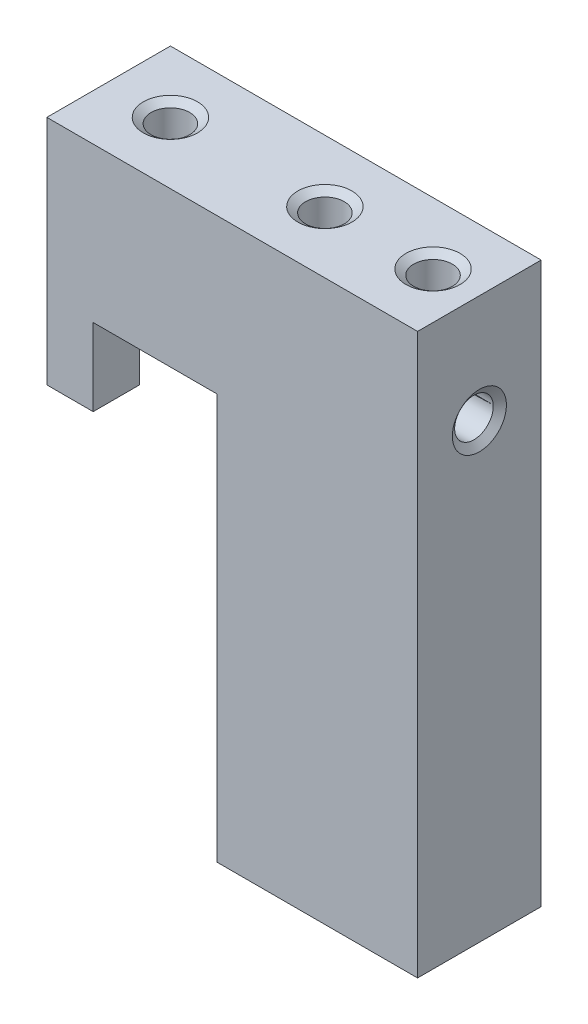
ISO-10303-21;
HEADER;
FILE_DESCRIPTION(('STEP AP214'),'2;1');
FILE_NAME('part.step','',(''),(''),'','','');
FILE_SCHEMA(('AUTOMOTIVE_DESIGN { 1 0 10303 214 1 1 1 1 }'));
ENDSEC;
DATA;
#1=APPLICATION_CONTEXT('core data for automotive mechanical design processes');
#2=APPLICATION_PROTOCOL_DEFINITION('international standard','automotive_design',2000,#1);
#3=PRODUCT_CONTEXT('',#1,'mechanical');
#4=PRODUCT('Part','Part','',(#3));
#5=PRODUCT_RELATED_PRODUCT_CATEGORY('part','',(#4));
#6=PRODUCT_DEFINITION_FORMATION('','',#4);
#7=PRODUCT_DEFINITION_CONTEXT('part definition',#1,'design');
#8=PRODUCT_DEFINITION('design','',#6,#7);
#9=PRODUCT_DEFINITION_SHAPE('','',#8);
#10=(LENGTH_UNIT() NAMED_UNIT(*) SI_UNIT(.MILLI.,.METRE.));
#11=(NAMED_UNIT(*) PLANE_ANGLE_UNIT() SI_UNIT($,.RADIAN.));
#12=(NAMED_UNIT(*) SI_UNIT($,.STERADIAN.) SOLID_ANGLE_UNIT());
#13=UNCERTAINTY_MEASURE_WITH_UNIT(LENGTH_MEASURE(1.E-05),#10,'distance_accuracy_value','');
#14=(GEOMETRIC_REPRESENTATION_CONTEXT(3) GLOBAL_UNCERTAINTY_ASSIGNED_CONTEXT((#13)) GLOBAL_UNIT_ASSIGNED_CONTEXT((#10,
#11,#12)) REPRESENTATION_CONTEXT('',''));
#15=CARTESIAN_POINT('',(0.,0.,0.));
#16=DIRECTION('',(0.,0.,1.));
#17=DIRECTION('',(1.,0.,0.));
#18=AXIS2_PLACEMENT_3D('',#15,#16,#17);
#19=CARTESIAN_POINT('',(11.,26.25,8.));
#20=DIRECTION('',(1.,0.,0.));
#21=DIRECTION('',(0.,1.,0.));
#22=AXIS2_PLACEMENT_3D('',#19,#20,#21);
#23=PLANE('',#22);
#24=DIRECTION('',(0.,-1.,0.));
#25=VECTOR('',#24,1.);
#26=CARTESIAN_POINT('',(11.,18.125,5.));
#27=LINE('',#26,#25);
#28=CARTESIAN_POINT('',(11.,26.25,5.));
#29=VERTEX_POINT('',#28);
#30=CARTESIAN_POINT('',(11.,0.,5.));
#31=VERTEX_POINT('',#30);
#32=EDGE_CURVE('E51',#29,#31,#27,.T.);
#33=ORIENTED_EDGE('',*,*,#32,.T.);
#34=DIRECTION('',(0.,0.,-1.));
#35=VECTOR('',#34,1.);
#36=CARTESIAN_POINT('',(11.,0.,8.));
#37=LINE('',#36,#35);
#38=CARTESIAN_POINT('',(11.,0.,8.));
#39=VERTEX_POINT('',#38);
#40=EDGE_CURVE('E291',#39,#31,#37,.T.);
#41=ORIENTED_EDGE('',*,*,#40,.F.);
#42=DIRECTION('',(0.,-1.,0.));
#43=VECTOR('',#42,1.);
#44=CARTESIAN_POINT('',(11.,26.25,8.));
#45=LINE('',#44,#43);
#46=CARTESIAN_POINT('',(11.,26.25,8.));
#47=VERTEX_POINT('',#46);
#48=EDGE_CURVE('E289',#47,#39,#45,.T.);
#49=ORIENTED_EDGE('',*,*,#48,.F.);
#50=DIRECTION('',(0.,0.,-1.));
#51=VECTOR('',#50,1.);
#52=CARTESIAN_POINT('',(11.,26.25,8.));
#53=LINE('',#52,#51);
#54=EDGE_CURVE('E292',#47,#29,#53,.T.);
#55=ORIENTED_EDGE('',*,*,#54,.T.);
#56=EDGE_LOOP('',(#33,#41,#49,#55));
#57=FACE_BOUND('',#56,.T.);
#58=ADVANCED_FACE('F36',(#57),#23,.F.);
#59=CARTESIAN_POINT('',(0.,0.,8.));
#60=DIRECTION('',(1.,0.,0.));
#61=DIRECTION('',(0.,0.,-1.));
#62=AXIS2_PLACEMENT_3D('',#59,#60,#61);
#63=PLANE('',#62);
#64=CARTESIAN_POINT('',(0.,29.25,4.));
#65=DIRECTION('',(-1.,0.,0.));
#66=DIRECTION('',(0.,0.,1.));
#67=AXIS2_PLACEMENT_3D('',#64,#65,#66);
#68=CIRCLE('',#67,1.75);
#69=CARTESIAN_POINT('',(0.,29.25,5.75));
#70=VERTEX_POINT('',#69);
#71=EDGE_CURVE('E261',#70,#70,#68,.T.);
#72=ORIENTED_EDGE('',*,*,#71,.F.);
#73=EDGE_LOOP('',(#72));
#74=FACE_BOUND('',#73,.T.);
#75=DIRECTION('',(0.,0.,-1.));
#76=VECTOR('',#75,1.);
#77=CARTESIAN_POINT('',(0.,23.25,35.0474120758345));
#78=LINE('',#77,#76);
#79=CARTESIAN_POINT('',(0.,23.25,5.));
#80=VERTEX_POINT('',#79);
#81=CARTESIAN_POINT('',(0.,23.25,0.));
#82=VERTEX_POINT('',#81);
#83=EDGE_CURVE('E235',#80,#82,#78,.T.);
#84=ORIENTED_EDGE('',*,*,#83,.F.);
#85=DIRECTION('',(0.,-1.,0.));
#86=VECTOR('',#85,1.);
#87=CARTESIAN_POINT('',(0.,18.125,5.));
#88=LINE('',#87,#86);
#89=CARTESIAN_POINT('',(0.,21.25,5.));
#90=VERTEX_POINT('',#89);
#91=EDGE_CURVE('E219',#80,#90,#88,.T.);
#92=ORIENTED_EDGE('',*,*,#91,.T.);
#93=DIRECTION('',(0.,0.,-1.));
#94=VECTOR('',#93,1.);
#95=CARTESIAN_POINT('',(0.,21.25,8.));
#96=LINE('',#95,#94);
#97=CARTESIAN_POINT('',(0.,21.25,8.));
#98=VERTEX_POINT('',#97);
#99=EDGE_CURVE('E288',#98,#90,#96,.T.);
#100=ORIENTED_EDGE('',*,*,#99,.F.);
#101=DIRECTION('',(0.,-1.,0.));
#102=VECTOR('',#101,1.);
#103=CARTESIAN_POINT('',(0.,0.,8.));
#104=LINE('',#103,#102);
#105=CARTESIAN_POINT('',(0.,36.25,8.));
#106=VERTEX_POINT('',#105);
#107=EDGE_CURVE('E312',#106,#98,#104,.T.);
#108=ORIENTED_EDGE('',*,*,#107,.F.);
#109=DIRECTION('',(0.,0.,-1.));
#110=VECTOR('',#109,1.);
#111=CARTESIAN_POINT('',(0.,36.25,8.));
#112=LINE('',#111,#110);
#113=CARTESIAN_POINT('',(0.,36.25,0.));
#114=VERTEX_POINT('',#113);
#115=EDGE_CURVE('E322',#106,#114,#112,.T.);
#116=ORIENTED_EDGE('',*,*,#115,.T.);
#117=DIRECTION('',(0.,-1.,0.));
#118=VECTOR('',#117,1.);
#119=CARTESIAN_POINT('',(0.,0.,0.));
#120=LINE('',#119,#118);
#121=EDGE_CURVE('E309',#114,#82,#120,.T.);
#122=ORIENTED_EDGE('',*,*,#121,.T.);
#123=EDGE_LOOP('',(#84,#92,#100,#108,#116,#122));
#124=FACE_BOUND('',#123,.T.);
#125=ADVANCED_FACE('F38',(#74,#124),#63,.F.);
#126=CARTESIAN_POINT('',(0.,36.25,0.));
#127=DIRECTION('',(0.,0.,-1.));
#128=DIRECTION('',(-1.,0.,0.));
#129=AXIS2_PLACEMENT_3D('',#126,#127,#128);
#130=PLANE('',#129);
#131=CARTESIAN_POINT('',(12.,24.25,0.));
#132=DIRECTION('',(0.,0.,-1.));
#133=DIRECTION('',(-1.,0.,0.));
#134=AXIS2_PLACEMENT_3D('',#131,#132,#133);
#135=CIRCLE('',#134,2.5);
#136=CARTESIAN_POINT('',(10.5,26.25,0.));
#137=VERTEX_POINT('',#136);
#138=CARTESIAN_POINT('',(14.5,24.25,0.));
#139=VERTEX_POINT('',#138);
#140=EDGE_CURVE('E200',#137,#139,#135,.T.);
#141=ORIENTED_EDGE('',*,*,#140,.F.);
#142=DIRECTION('',(1.,0.,0.));
#143=VECTOR('',#142,1.);
#144=CARTESIAN_POINT('',(0.,26.25,0.));
#145=LINE('',#144,#143);
#146=CARTESIAN_POINT('',(3.,26.25,0.));
#147=VERTEX_POINT('',#146);
#148=EDGE_CURVE('E339',#147,#137,#145,.T.);
#149=ORIENTED_EDGE('',*,*,#148,.F.);
#150=DIRECTION('',(0.,1.,0.));
#151=VECTOR('',#150,1.);
#152=CARTESIAN_POINT('',(3.,36.25,0.));
#153=LINE('',#152,#151);
#154=CARTESIAN_POINT('',(3.,25.0292254112385,0.));
#155=VERTEX_POINT('',#154);
#156=EDGE_CURVE('E337',#155,#147,#153,.T.);
#157=ORIENTED_EDGE('',*,*,#156,.F.);
#158=DIRECTION('',(-0.819152044288995,-0.573576436351041,0.));
#159=VECTOR('',#158,1.);
#160=CARTESIAN_POINT('',(-16.9902681636719,11.0318889522021,0.));
#161=LINE('',#160,#159);
#162=CARTESIAN_POINT('',(0.45900277539471,23.25,0.));
#163=VERTEX_POINT('',#162);
#164=EDGE_CURVE('E215',#155,#163,#161,.T.);
#165=ORIENTED_EDGE('',*,*,#164,.T.);
#166=DIRECTION('',(-1.,0.,0.));
#167=VECTOR('',#166,1.);
#168=CARTESIAN_POINT('',(-21.9569179886986,23.25,0.));
#169=LINE('',#168,#167);
#170=EDGE_CURVE('E230',#163,#82,#169,.T.);
#171=ORIENTED_EDGE('',*,*,#170,.T.);
#172=ORIENTED_EDGE('',*,*,#121,.F.);
#173=DIRECTION('',(-1.,0.,0.));
#174=VECTOR('',#173,1.);
#175=CARTESIAN_POINT('',(0.,36.25,0.));
#176=LINE('',#175,#174);
#177=CARTESIAN_POINT('',(24.,36.25,0.));
#178=VERTEX_POINT('',#177);
#179=EDGE_CURVE('E316',#178,#114,#176,.T.);
#180=ORIENTED_EDGE('',*,*,#179,.F.);
#181=DIRECTION('',(0.,1.,0.));
#182=VECTOR('',#181,1.);
#183=CARTESIAN_POINT('',(24.,0.,0.));
#184=LINE('',#183,#182);
#185=CARTESIAN_POINT('',(24.,0.,0.));
#186=VERTEX_POINT('',#185);
#187=EDGE_CURVE('E326',#186,#178,#184,.T.);
#188=ORIENTED_EDGE('',*,*,#187,.F.);
#189=DIRECTION('',(1.,0.,0.));
#190=VECTOR('',#189,1.);
#191=CARTESIAN_POINT('',(0.,0.,0.));
#192=LINE('',#191,#190);
#193=CARTESIAN_POINT('',(12.,0.,0.));
#194=VERTEX_POINT('',#193);
#195=EDGE_CURVE('E199',#194,#186,#192,.T.);
#196=ORIENTED_EDGE('',*,*,#195,.F.);
#197=DIRECTION('',(0.,-1.,0.));
#198=VECTOR('',#197,1.);
#199=CARTESIAN_POINT('',(12.,18.125,0.));
#200=LINE('',#199,#198);
#201=CARTESIAN_POINT('',(12.,20.75,0.));
#202=VERTEX_POINT('',#201);
#203=EDGE_CURVE('E177',#202,#194,#200,.T.);
#204=ORIENTED_EDGE('',*,*,#203,.F.);
#205=CARTESIAN_POINT('',(12.,23.25,0.));
#206=DIRECTION('',(0.,0.,-1.));
#207=DIRECTION('',(-1.,0.,0.));
#208=AXIS2_PLACEMENT_3D('',#205,#206,#207);
#209=CIRCLE('',#208,2.5);
#210=CARTESIAN_POINT('',(14.5,23.25,0.));
#211=VERTEX_POINT('',#210);
#212=EDGE_CURVE('E187',#202,#211,#209,.F.);
#213=ORIENTED_EDGE('',*,*,#212,.T.);
#214=DIRECTION('',(0.,-1.,0.));
#215=VECTOR('',#214,1.);
#216=CARTESIAN_POINT('',(14.5,18.125,0.));
#217=LINE('',#216,#215);
#218=EDGE_CURVE('E184',#139,#211,#217,.T.);
#219=ORIENTED_EDGE('',*,*,#218,.F.);
#220=EDGE_LOOP('',(#141,#149,#157,#165,#171,#172,#180,#188,#196,#204,#213,#219));
#221=FACE_BOUND('',#220,.T.);
#222=ADVANCED_FACE('F197',(#221),#130,.T.);
#223=CARTESIAN_POINT('',(3.,26.25,8.));
#224=DIRECTION('',(-1.,0.,0.));
#225=DIRECTION('',(0.,-1.,0.));
#226=AXIS2_PLACEMENT_3D('',#223,#224,#225);
#227=PLANE('',#226);
#228=DIRECTION('',(0.,0.,-1.));
#229=VECTOR('',#228,1.);
#230=CARTESIAN_POINT('',(3.,25.0292254112385,35.0474120758345));
#231=LINE('',#230,#229);
#232=CARTESIAN_POINT('',(3.,25.0292254112385,5.));
#233=VERTEX_POINT('',#232);
#234=EDGE_CURVE('E233',#233,#155,#231,.T.);
#235=ORIENTED_EDGE('',*,*,#234,.T.);
#236=ORIENTED_EDGE('',*,*,#156,.T.);
#237=DIRECTION('',(0.,0.,-1.));
#238=VECTOR('',#237,1.);
#239=CARTESIAN_POINT('',(3.,26.25,8.));
#240=LINE('',#239,#238);
#241=CARTESIAN_POINT('',(3.,26.25,8.));
#242=VERTEX_POINT('',#241);
#243=EDGE_CURVE('E295',#242,#147,#240,.T.);
#244=ORIENTED_EDGE('',*,*,#243,.F.);
#245=DIRECTION('',(0.,1.,0.));
#246=VECTOR('',#245,1.);
#247=CARTESIAN_POINT('',(3.,26.25,8.));
#248=LINE('',#247,#246);
#249=CARTESIAN_POINT('',(3.,21.25,8.));
#250=VERTEX_POINT('',#249);
#251=EDGE_CURVE('E296',#250,#242,#248,.T.);
#252=ORIENTED_EDGE('',*,*,#251,.F.);
#253=DIRECTION('',(0.,0.,-1.));
#254=VECTOR('',#253,1.);
#255=CARTESIAN_POINT('',(3.,21.25,8.));
#256=LINE('',#255,#254);
#257=CARTESIAN_POINT('',(3.,21.25,5.));
#258=VERTEX_POINT('',#257);
#259=EDGE_CURVE('E298',#250,#258,#256,.T.);
#260=ORIENTED_EDGE('',*,*,#259,.T.);
#261=DIRECTION('',(0.,1.,0.));
#262=VECTOR('',#261,1.);
#263=CARTESIAN_POINT('',(3.,18.125,5.));
#264=LINE('',#263,#262);
#265=EDGE_CURVE('E59',#258,#233,#264,.T.);
#266=ORIENTED_EDGE('',*,*,#265,.T.);
#267=EDGE_LOOP('',(#235,#236,#244,#252,#260,#266));
#268=FACE_BOUND('',#267,.T.);
#269=ADVANCED_FACE('F392',(#268),#227,.F.);
#270=CARTESIAN_POINT('',(3.,21.25,8.));
#271=DIRECTION('',(0.,1.,0.));
#272=DIRECTION('',(0.,0.,1.));
#273=AXIS2_PLACEMENT_3D('',#270,#271,#272);
#274=PLANE('',#273);
#275=DIRECTION('',(1.,0.,0.));
#276=VECTOR('',#275,1.);
#277=CARTESIAN_POINT('',(-21.9569179886986,21.25,5.));
#278=LINE('',#277,#276);
#279=EDGE_CURVE('E217',#90,#258,#278,.T.);
#280=ORIENTED_EDGE('',*,*,#279,.T.);
#281=ORIENTED_EDGE('',*,*,#259,.F.);
#282=DIRECTION('',(1.,0.,0.));
#283=VECTOR('',#282,1.);
#284=CARTESIAN_POINT('',(3.,21.25,8.));
#285=LINE('',#284,#283);
#286=EDGE_CURVE('E299',#98,#250,#285,.T.);
#287=ORIENTED_EDGE('',*,*,#286,.F.);
#288=ORIENTED_EDGE('',*,*,#99,.T.);
#289=EDGE_LOOP('',(#280,#281,#287,#288));
#290=FACE_BOUND('',#289,.T.);
#291=ADVANCED_FACE('F401',(#290),#274,.F.);
#292=CARTESIAN_POINT('',(0.,0.,8.));
#293=DIRECTION('',(0.,1.,0.));
#294=DIRECTION('',(0.,0.,1.));
#295=AXIS2_PLACEMENT_3D('',#292,#293,#294);
#296=PLANE('',#295);
#297=CARTESIAN_POINT('',(15.,0.,4.));
#298=DIRECTION('',(0.,-1.,0.));
#299=DIRECTION('',(0.,0.,-1.));
#300=AXIS2_PLACEMENT_3D('',#297,#298,#299);
#301=CIRCLE('',#300,1.6);
#302=CARTESIAN_POINT('',(15.,0.,2.4));
#303=VERTEX_POINT('',#302);
#304=EDGE_CURVE('E270',#303,#303,#301,.T.);
#305=ORIENTED_EDGE('',*,*,#304,.F.);
#306=EDGE_LOOP('',(#305));
#307=FACE_BOUND('',#306,.T.);
#308=CARTESIAN_POINT('',(20.,0.,4.));
#309=DIRECTION('',(0.,-1.,0.));
#310=DIRECTION('',(0.,0.,-1.));
#311=AXIS2_PLACEMENT_3D('',#308,#309,#310);
#312=CIRCLE('',#311,1.6);
#313=CARTESIAN_POINT('',(20.,0.,2.4));
#314=VERTEX_POINT('',#313);
#315=EDGE_CURVE('E279',#314,#314,#312,.T.);
#316=ORIENTED_EDGE('',*,*,#315,.F.);
#317=EDGE_LOOP('',(#316));
#318=FACE_BOUND('',#317,.T.);
#319=DIRECTION('',(1.,0.,0.));
#320=VECTOR('',#319,1.);
#321=CARTESIAN_POINT('',(-21.9569179886986,0.,5.));
#322=LINE('',#321,#320);
#323=CARTESIAN_POINT('',(12.,0.,5.));
#324=VERTEX_POINT('',#323);
#325=EDGE_CURVE('E208',#31,#324,#322,.T.);
#326=ORIENTED_EDGE('',*,*,#325,.T.);
#327=DIRECTION('',(0.,0.,-1.));
#328=VECTOR('',#327,1.);
#329=CARTESIAN_POINT('',(12.,0.,35.0474120758345));
#330=LINE('',#329,#328);
#331=EDGE_CURVE('E183',#324,#194,#330,.T.);
#332=ORIENTED_EDGE('',*,*,#331,.T.);
#333=ORIENTED_EDGE('',*,*,#195,.T.);
#334=DIRECTION('',(0.,0.,-1.));
#335=VECTOR('',#334,1.);
#336=CARTESIAN_POINT('',(24.,0.,8.));
#337=LINE('',#336,#335);
#338=CARTESIAN_POINT('',(24.,0.,8.));
#339=VERTEX_POINT('',#338);
#340=EDGE_CURVE('E334',#339,#186,#337,.T.);
#341=ORIENTED_EDGE('',*,*,#340,.F.);
#342=DIRECTION('',(1.,0.,0.));
#343=VECTOR('',#342,1.);
#344=CARTESIAN_POINT('',(0.,0.,8.));
#345=LINE('',#344,#343);
#346=EDGE_CURVE('E315',#39,#339,#345,.T.);
#347=ORIENTED_EDGE('',*,*,#346,.F.);
#348=ORIENTED_EDGE('',*,*,#40,.T.);
#349=EDGE_LOOP('',(#326,#332,#333,#341,#347,#348));
#350=FACE_BOUND('',#349,.T.);
#351=ADVANCED_FACE('F398',(#307,#318,#350),#296,.F.);
#352=CARTESIAN_POINT('',(24.,0.,8.));
#353=DIRECTION('',(-1.,0.,0.));
#354=DIRECTION('',(0.,0.,1.));
#355=AXIS2_PLACEMENT_3D('',#352,#353,#354);
#356=PLANE('',#355);
#357=CARTESIAN_POINT('',(24.,29.25,4.));
#358=DIRECTION('',(-1.,0.,0.));
#359=DIRECTION('',(0.,0.,1.));
#360=AXIS2_PLACEMENT_3D('',#357,#358,#359);
#361=CIRCLE('',#360,1.74999999999999);
#362=CARTESIAN_POINT('',(24.,29.25,5.74999999999999));
#363=VERTEX_POINT('',#362);
#364=EDGE_CURVE('E258',#363,#363,#361,.T.);
#365=ORIENTED_EDGE('',*,*,#364,.T.);
#366=EDGE_LOOP('',(#365));
#367=FACE_BOUND('',#366,.T.);
#368=ORIENTED_EDGE('',*,*,#187,.T.);
#369=DIRECTION('',(0.,0.,-1.));
#370=VECTOR('',#369,1.);
#371=CARTESIAN_POINT('',(24.,36.25,8.));
#372=LINE('',#371,#370);
#373=CARTESIAN_POINT('',(24.,36.25,8.));
#374=VERTEX_POINT('',#373);
#375=EDGE_CURVE('E331',#374,#178,#372,.T.);
#376=ORIENTED_EDGE('',*,*,#375,.F.);
#377=DIRECTION('',(0.,1.,0.));
#378=VECTOR('',#377,1.);
#379=CARTESIAN_POINT('',(24.,0.,8.));
#380=LINE('',#379,#378);
#381=EDGE_CURVE('E318',#339,#374,#380,.T.);
#382=ORIENTED_EDGE('',*,*,#381,.F.);
#383=ORIENTED_EDGE('',*,*,#340,.T.);
#384=EDGE_LOOP('',(#368,#376,#382,#383));
#385=FACE_BOUND('',#384,.T.);
#386=ADVANCED_FACE('F395',(#367,#385),#356,.F.);
#387=CARTESIAN_POINT('',(0.,36.25,8.));
#388=DIRECTION('',(0.,-1.,0.));
#389=DIRECTION('',(0.,0.,-1.));
#390=AXIS2_PLACEMENT_3D('',#387,#388,#389);
#391=PLANE('',#390);
#392=CARTESIAN_POINT('',(14.,36.25,3.99999999999995));
#393=DIRECTION('',(0.,1.,0.));
#394=DIRECTION('',(0.,0.,1.));
#395=AXIS2_PLACEMENT_3D('',#392,#393,#394);
#396=CIRCLE('',#395,1.75);
#397=CARTESIAN_POINT('',(14.,36.25,5.74999999999995));
#398=VERTEX_POINT('',#397);
#399=EDGE_CURVE('E240',#398,#398,#396,.T.);
#400=ORIENTED_EDGE('',*,*,#399,.F.);
#401=EDGE_LOOP('',(#400));
#402=FACE_BOUND('',#401,.T.);
#403=CARTESIAN_POINT('',(4.,36.25,3.99999999999995));
#404=DIRECTION('',(0.,1.,0.));
#405=DIRECTION('',(0.,0.,1.));
#406=AXIS2_PLACEMENT_3D('',#403,#404,#405);
#407=CIRCLE('',#406,1.75);
#408=CARTESIAN_POINT('',(4.,36.25,5.74999999999995));
#409=VERTEX_POINT('',#408);
#410=EDGE_CURVE('E246',#409,#409,#407,.T.);
#411=ORIENTED_EDGE('',*,*,#410,.F.);
#412=EDGE_LOOP('',(#411));
#413=FACE_BOUND('',#412,.T.);
#414=CARTESIAN_POINT('',(21.,36.25,3.99999999999995));
#415=DIRECTION('',(0.,1.,0.));
#416=DIRECTION('',(0.,0.,1.));
#417=AXIS2_PLACEMENT_3D('',#414,#415,#416);
#418=CIRCLE('',#417,1.75);
#419=CARTESIAN_POINT('',(21.,36.25,5.74999999999995));
#420=VERTEX_POINT('',#419);
#421=EDGE_CURVE('E252',#420,#420,#418,.T.);
#422=ORIENTED_EDGE('',*,*,#421,.F.);
#423=EDGE_LOOP('',(#422));
#424=FACE_BOUND('',#423,.T.);
#425=ORIENTED_EDGE('',*,*,#179,.T.);
#426=ORIENTED_EDGE('',*,*,#115,.F.);
#427=DIRECTION('',(-1.,0.,0.));
#428=VECTOR('',#427,1.);
#429=CARTESIAN_POINT('',(0.,36.25,8.));
#430=LINE('',#429,#428);
#431=EDGE_CURVE('E320',#374,#106,#430,.T.);
#432=ORIENTED_EDGE('',*,*,#431,.F.);
#433=ORIENTED_EDGE('',*,*,#375,.T.);
#434=EDGE_LOOP('',(#425,#426,#432,#433));
#435=FACE_BOUND('',#434,.T.);
#436=ADVANCED_FACE('F388',(#402,#413,#424,#435),#391,.F.);
#437=CARTESIAN_POINT('',(0.,36.25,8.));
#438=DIRECTION('',(0.,0.,-1.));
#439=DIRECTION('',(-1.,0.,0.));
#440=AXIS2_PLACEMENT_3D('',#437,#438,#439);
#441=PLANE('',#440);
#442=DIRECTION('',(1.,0.,0.));
#443=VECTOR('',#442,1.);
#444=CARTESIAN_POINT('',(3.,26.25,8.));
#445=LINE('',#444,#443);
#446=EDGE_CURVE('E293',#242,#47,#445,.T.);
#447=ORIENTED_EDGE('',*,*,#446,.T.);
#448=ORIENTED_EDGE('',*,*,#48,.T.);
#449=ORIENTED_EDGE('',*,*,#346,.T.);
#450=ORIENTED_EDGE('',*,*,#381,.T.);
#451=ORIENTED_EDGE('',*,*,#431,.T.);
#452=ORIENTED_EDGE('',*,*,#107,.T.);
#453=ORIENTED_EDGE('',*,*,#286,.T.);
#454=ORIENTED_EDGE('',*,*,#251,.T.);
#455=EDGE_LOOP('',(#447,#448,#449,#450,#451,#452,#453,#454));
#456=FACE_BOUND('',#455,.T.);
#457=ADVANCED_FACE('F385',(#456),#441,.F.);
#458=CARTESIAN_POINT('',(3.,26.25,8.));
#459=DIRECTION('',(0.,1.,0.));
#460=DIRECTION('',(0.,0.,1.));
#461=AXIS2_PLACEMENT_3D('',#458,#459,#460);
#462=PLANE('',#461);
#463=ORIENTED_EDGE('',*,*,#148,.T.);
#464=DIRECTION('',(0.,0.,-1.));
#465=VECTOR('',#464,1.);
#466=CARTESIAN_POINT('',(10.5,26.25,35.0474120758345));
#467=LINE('',#466,#465);
#468=CARTESIAN_POINT('',(10.5,26.25,5.));
#469=VERTEX_POINT('',#468);
#470=EDGE_CURVE('E211',#469,#137,#467,.T.);
#471=ORIENTED_EDGE('',*,*,#470,.F.);
#472=DIRECTION('',(1.,0.,0.));
#473=VECTOR('',#472,1.);
#474=CARTESIAN_POINT('',(-21.9569179886986,26.25,5.));
#475=LINE('',#474,#473);
#476=EDGE_CURVE('E416',#469,#29,#475,.T.);
#477=ORIENTED_EDGE('',*,*,#476,.T.);
#478=ORIENTED_EDGE('',*,*,#54,.F.);
#479=ORIENTED_EDGE('',*,*,#446,.F.);
#480=ORIENTED_EDGE('',*,*,#243,.T.);
#481=EDGE_LOOP('',(#463,#471,#477,#478,#479,#480));
#482=FACE_BOUND('',#481,.T.);
#483=ADVANCED_FACE('F383',(#482),#462,.F.);
#484=CARTESIAN_POINT('',(20.,10.5,4.));
#485=DIRECTION('',(0.,-1.,0.));
#486=DIRECTION('',(0.,0.,-1.));
#487=AXIS2_PLACEMENT_3D('',#484,#485,#486);
#488=CONICAL_SURFACE('',#487,1.24999999999999,1.02974425867665);
#489=CARTESIAN_POINT('',(20.,11.2510757737844,4.));
#490=VERTEX_POINT('',#489);
#491=VERTEX_LOOP('',#490);
#492=FACE_BOUND('',#491,.T.);
#493=CARTESIAN_POINT('',(20.,10.5,4.));
#494=DIRECTION('',(0.,-1.,0.));
#495=DIRECTION('',(0.,0.,-1.));
#496=AXIS2_PLACEMENT_3D('',#493,#494,#495);
#497=CIRCLE('',#496,1.24999999999999);
#498=CARTESIAN_POINT('',(20.,10.5,2.75000000000001));
#499=VERTEX_POINT('',#498);
#500=EDGE_CURVE('E285',#499,#499,#497,.T.);
#501=ORIENTED_EDGE('',*,*,#500,.T.);
#502=EDGE_LOOP('',(#501));
#503=FACE_BOUND('',#502,.T.);
#504=ADVANCED_FACE('F672',(#492,#503),#488,.F.);
#505=CARTESIAN_POINT('',(20.,0.,4.));
#506=DIRECTION('',(0.,-1.,0.));
#507=DIRECTION('',(0.,0.,-1.));
#508=AXIS2_PLACEMENT_3D('',#505,#506,#507);
#509=CYLINDRICAL_SURFACE('',#508,1.24999999999999);
#510=ORIENTED_EDGE('',*,*,#500,.F.);
#511=EDGE_LOOP('',(#510));
#512=FACE_BOUND('',#511,.T.);
#513=CARTESIAN_POINT('',(20.,0.245072638373398,4.));
#514=DIRECTION('',(0.,-1.,0.));
#515=DIRECTION('',(0.,0.,-1.));
#516=AXIS2_PLACEMENT_3D('',#513,#514,#515);
#517=CIRCLE('',#516,1.25);
#518=CARTESIAN_POINT('',(20.,0.245072638373398,2.75));
#519=VERTEX_POINT('',#518);
#520=EDGE_CURVE('E282',#519,#519,#517,.T.);
#521=ORIENTED_EDGE('',*,*,#520,.T.);
#522=EDGE_LOOP('',(#521));
#523=FACE_BOUND('',#522,.T.);
#524=ADVANCED_FACE('F663',(#512,#523),#509,.F.);
#525=CARTESIAN_POINT('',(20.,0.,4.));
#526=DIRECTION('',(0.,-1.,0.));
#527=DIRECTION('',(0.,0.,-1.));
#528=AXIS2_PLACEMENT_3D('',#525,#526,#527);
#529=CONICAL_SURFACE('',#528,1.6,0.959931088596886);
#530=ORIENTED_EDGE('',*,*,#520,.F.);
#531=EDGE_LOOP('',(#530));
#532=FACE_BOUND('',#531,.T.);
#533=ORIENTED_EDGE('',*,*,#315,.T.);
#534=EDGE_LOOP('',(#533));
#535=FACE_BOUND('',#534,.T.);
#536=ADVANCED_FACE('F654',(#532,#535),#529,.F.);
#537=CARTESIAN_POINT('',(15.,10.5,4.));
#538=DIRECTION('',(0.,-1.,0.));
#539=DIRECTION('',(0.,0.,-1.));
#540=AXIS2_PLACEMENT_3D('',#537,#538,#539);
#541=CONICAL_SURFACE('',#540,1.24999999999999,1.02974425867665);
#542=CARTESIAN_POINT('',(15.,11.2510757737844,4.));
#543=VERTEX_POINT('',#542);
#544=VERTEX_LOOP('',#543);
#545=FACE_BOUND('',#544,.T.);
#546=CARTESIAN_POINT('',(15.,10.5,4.));
#547=DIRECTION('',(0.,-1.,0.));
#548=DIRECTION('',(0.,0.,-1.));
#549=AXIS2_PLACEMENT_3D('',#546,#547,#548);
#550=CIRCLE('',#549,1.24999999999999);
#551=CARTESIAN_POINT('',(15.,10.5,2.75000000000001));
#552=VERTEX_POINT('',#551);
#553=EDGE_CURVE('E276',#552,#552,#550,.T.);
#554=ORIENTED_EDGE('',*,*,#553,.T.);
#555=EDGE_LOOP('',(#554));
#556=FACE_BOUND('',#555,.T.);
#557=ADVANCED_FACE('F644',(#545,#556),#541,.F.);
#558=CARTESIAN_POINT('',(15.,0.,4.));
#559=DIRECTION('',(0.,-1.,0.));
#560=DIRECTION('',(0.,0.,-1.));
#561=AXIS2_PLACEMENT_3D('',#558,#559,#560);
#562=CYLINDRICAL_SURFACE('',#561,1.24999999999999);
#563=ORIENTED_EDGE('',*,*,#553,.F.);
#564=EDGE_LOOP('',(#563));
#565=FACE_BOUND('',#564,.T.);
#566=CARTESIAN_POINT('',(15.,0.245072638373398,4.));
#567=DIRECTION('',(0.,-1.,0.));
#568=DIRECTION('',(0.,0.,-1.));
#569=AXIS2_PLACEMENT_3D('',#566,#567,#568);
#570=CIRCLE('',#569,1.25);
#571=CARTESIAN_POINT('',(15.,0.245072638373398,2.75));
#572=VERTEX_POINT('',#571);
#573=EDGE_CURVE('E273',#572,#572,#570,.T.);
#574=ORIENTED_EDGE('',*,*,#573,.T.);
#575=EDGE_LOOP('',(#574));
#576=FACE_BOUND('',#575,.T.);
#577=ADVANCED_FACE('F635',(#565,#576),#562,.F.);
#578=CARTESIAN_POINT('',(15.,0.,4.));
#579=DIRECTION('',(0.,-1.,0.));
#580=DIRECTION('',(0.,0.,-1.));
#581=AXIS2_PLACEMENT_3D('',#578,#579,#580);
#582=CONICAL_SURFACE('',#581,1.6,0.959931088596886);
#583=ORIENTED_EDGE('',*,*,#573,.F.);
#584=EDGE_LOOP('',(#583));
#585=FACE_BOUND('',#584,.T.);
#586=ORIENTED_EDGE('',*,*,#304,.T.);
#587=EDGE_LOOP('',(#586));
#588=FACE_BOUND('',#587,.T.);
#589=ADVANCED_FACE('F625',(#585,#588),#582,.F.);
#590=CARTESIAN_POINT('',(23.6498962308951,29.25,4.));
#591=DIRECTION('',(1.,0.,0.));
#592=DIRECTION('',(0.,0.,-1.));
#593=AXIS2_PLACEMENT_3D('',#590,#591,#592);
#594=CONICAL_SURFACE('',#593,1.24999999999999,0.959931088596874);
#595=ORIENTED_EDGE('',*,*,#364,.F.);
#596=EDGE_LOOP('',(#595));
#597=FACE_BOUND('',#596,.T.);
#598=CARTESIAN_POINT('',(23.6498962308951,29.25,4.));
#599=DIRECTION('',(-1.,0.,0.));
#600=DIRECTION('',(0.,0.,1.));
#601=AXIS2_PLACEMENT_3D('',#598,#599,#600);
#602=CIRCLE('',#601,1.24999999999999);
#603=CARTESIAN_POINT('',(23.6498962308951,29.25,5.24999999999999));
#604=VERTEX_POINT('',#603);
#605=EDGE_CURVE('E267',#604,#604,#602,.T.);
#606=ORIENTED_EDGE('',*,*,#605,.T.);
#607=EDGE_LOOP('',(#606));
#608=FACE_BOUND('',#607,.T.);
#609=ADVANCED_FACE('F617',(#597,#608),#594,.F.);
#610=CARTESIAN_POINT('',(0.,29.25,4.));
#611=DIRECTION('',(-1.,0.,0.));
#612=DIRECTION('',(0.,0.,1.));
#613=AXIS2_PLACEMENT_3D('',#610,#611,#612);
#614=CYLINDRICAL_SURFACE('',#613,1.25);
#615=CARTESIAN_POINT('',(14.,29.25,3.99999999999997));
#616=DIRECTION('',(-0.707106781186547,-0.707106781186547,0.));
#617=DIRECTION('',(-0.707106781186547,0.707106781186547,0.));
#618=AXIS2_PLACEMENT_3D('',#615,#616,#617);
#619=ELLIPSE('',#618,1.76776695296637,1.25);
#620=CARTESIAN_POINT('',(14.,29.25,2.75));
#621=VERTEX_POINT('',#620);
#622=CARTESIAN_POINT('',(14.,29.25,5.25));
#623=VERTEX_POINT('',#622);
#624=EDGE_CURVE('E44',#621,#623,#619,.F.);
#625=ORIENTED_EDGE('',*,*,#624,.T.);
#626=CARTESIAN_POINT('',(14.,29.25,3.99999999999997));
#627=DIRECTION('',(-0.707106781186547,0.707106781186547,0.));
#628=DIRECTION('',(-0.707106781186547,-0.707106781186547,0.));
#629=AXIS2_PLACEMENT_3D('',#626,#627,#628);
#630=ELLIPSE('',#629,1.76776695296637,1.25);
#631=EDGE_CURVE('E12',#623,#621,#630,.T.);
#632=ORIENTED_EDGE('',*,*,#631,.T.);
#633=EDGE_LOOP('',(#625,#632));
#634=FACE_BOUND('',#633,.T.);
#635=CARTESIAN_POINT('',(4.,29.25,3.99999999999997));
#636=DIRECTION('',(-0.707106781186547,-0.707106781186547,0.));
#637=DIRECTION('',(-0.707106781186547,0.707106781186547,0.));
#638=AXIS2_PLACEMENT_3D('',#635,#636,#637);
#639=ELLIPSE('',#638,1.76776695296637,1.25);
#640=CARTESIAN_POINT('',(4.,29.25,2.75));
#641=VERTEX_POINT('',#640);
#642=CARTESIAN_POINT('',(4.,29.25,5.25));
#643=VERTEX_POINT('',#642);
#644=EDGE_CURVE('E348',#641,#643,#639,.F.);
#645=ORIENTED_EDGE('',*,*,#644,.T.);
#646=CARTESIAN_POINT('',(4.,29.25,3.99999999999997));
#647=DIRECTION('',(-0.707106781186547,0.707106781186547,0.));
#648=DIRECTION('',(-0.707106781186547,-0.707106781186547,0.));
#649=AXIS2_PLACEMENT_3D('',#646,#647,#648);
#650=ELLIPSE('',#649,1.76776695296637,1.25);
#651=EDGE_CURVE('E351',#643,#641,#650,.T.);
#652=ORIENTED_EDGE('',*,*,#651,.T.);
#653=EDGE_LOOP('',(#645,#652));
#654=FACE_BOUND('',#653,.T.);
#655=CARTESIAN_POINT('',(21.,29.25,3.99999999999997));
#656=DIRECTION('',(-0.707106781186547,-0.707106781186547,0.));
#657=DIRECTION('',(-0.707106781186547,0.707106781186547,0.));
#658=AXIS2_PLACEMENT_3D('',#655,#656,#657);
#659=ELLIPSE('',#658,1.76776695296636,1.25);
#660=CARTESIAN_POINT('',(21.,29.25,2.75));
#661=VERTEX_POINT('',#660);
#662=CARTESIAN_POINT('',(21.,29.25,5.25));
#663=VERTEX_POINT('',#662);
#664=EDGE_CURVE('E342',#661,#663,#659,.F.);
#665=ORIENTED_EDGE('',*,*,#664,.T.);
#666=CARTESIAN_POINT('',(21.,29.25,3.99999999999997));
#667=DIRECTION('',(-0.707106781186547,0.707106781186547,0.));
#668=DIRECTION('',(-0.707106781186547,-0.707106781186547,0.));
#669=AXIS2_PLACEMENT_3D('',#666,#667,#668);
#670=ELLIPSE('',#669,1.76776695296636,1.25);
#671=EDGE_CURVE('E345',#663,#661,#670,.T.);
#672=ORIENTED_EDGE('',*,*,#671,.T.);
#673=EDGE_LOOP('',(#665,#672));
#674=FACE_BOUND('',#673,.T.);
#675=ORIENTED_EDGE('',*,*,#605,.F.);
#676=EDGE_LOOP('',(#675));
#677=FACE_BOUND('',#676,.T.);
#678=CARTESIAN_POINT('',(0.350103769104855,29.25,4.));
#679=DIRECTION('',(-1.,0.,0.));
#680=DIRECTION('',(0.,0.,1.));
#681=AXIS2_PLACEMENT_3D('',#678,#679,#680);
#682=CIRCLE('',#681,1.25);
#683=CARTESIAN_POINT('',(0.350103769104855,29.25,5.25));
#684=VERTEX_POINT('',#683);
#685=EDGE_CURVE('E264',#684,#684,#682,.T.);
#686=ORIENTED_EDGE('',*,*,#685,.T.);
#687=EDGE_LOOP('',(#686));
#688=FACE_BOUND('',#687,.T.);
#689=ADVANCED_FACE('F355',(#634,#654,#674,#677,#688),#614,.F.);
#690=CARTESIAN_POINT('',(0.,29.25,4.));
#691=DIRECTION('',(-1.,0.,0.));
#692=DIRECTION('',(0.,0.,1.));
#693=AXIS2_PLACEMENT_3D('',#690,#691,#692);
#694=CONICAL_SURFACE('',#693,1.75,0.959931088596882);
#695=ORIENTED_EDGE('',*,*,#685,.F.);
#696=EDGE_LOOP('',(#695));
#697=FACE_BOUND('',#696,.T.);
#698=ORIENTED_EDGE('',*,*,#71,.T.);
#699=EDGE_LOOP('',(#698));
#700=FACE_BOUND('',#699,.T.);
#701=ADVANCED_FACE('F597',(#697,#700),#694,.F.);
#702=CARTESIAN_POINT('',(21.,36.25,3.99999999999995));
#703=DIRECTION('',(0.,1.,0.));
#704=DIRECTION('',(0.,0.,1.));
#705=AXIS2_PLACEMENT_3D('',#702,#703,#704);
#706=CYLINDRICAL_SURFACE('',#705,1.25);
#707=CARTESIAN_POINT('',(21.,35.8998962308951,3.99999999999995));
#708=DIRECTION('',(0.,1.,0.));
#709=DIRECTION('',(0.,0.,1.));
#710=AXIS2_PLACEMENT_3D('',#707,#708,#709);
#711=CIRCLE('',#710,1.25);
#712=CARTESIAN_POINT('',(21.,35.8998962308951,5.24999999999995));
#713=VERTEX_POINT('',#712);
#714=EDGE_CURVE('E255',#713,#713,#711,.T.);
#715=ORIENTED_EDGE('',*,*,#714,.T.);
#716=EDGE_LOOP('',(#715));
#717=FACE_BOUND('',#716,.T.);
#718=ORIENTED_EDGE('',*,*,#664,.F.);
#719=ORIENTED_EDGE('',*,*,#671,.F.);
#720=EDGE_LOOP('',(#718,#719));
#721=FACE_BOUND('',#720,.T.);
#722=ADVANCED_FACE('F588',(#717,#721),#706,.F.);
#723=CARTESIAN_POINT('',(21.,36.25,3.99999999999995));
#724=DIRECTION('',(0.,1.,0.));
#725=DIRECTION('',(0.,0.,1.));
#726=AXIS2_PLACEMENT_3D('',#723,#724,#725);
#727=CONICAL_SURFACE('',#726,1.75,0.959931088596887);
#728=ORIENTED_EDGE('',*,*,#714,.F.);
#729=EDGE_LOOP('',(#728));
#730=FACE_BOUND('',#729,.T.);
#731=ORIENTED_EDGE('',*,*,#421,.T.);
#732=EDGE_LOOP('',(#731));
#733=FACE_BOUND('',#732,.T.);
#734=ADVANCED_FACE('F578',(#730,#733),#727,.F.);
#735=CARTESIAN_POINT('',(4.,36.25,3.99999999999995));
#736=DIRECTION('',(0.,1.,0.));
#737=DIRECTION('',(0.,0.,1.));
#738=AXIS2_PLACEMENT_3D('',#735,#736,#737);
#739=CYLINDRICAL_SURFACE('',#738,1.25);
#740=CARTESIAN_POINT('',(4.,35.8998962308951,3.99999999999995));
#741=DIRECTION('',(0.,1.,0.));
#742=DIRECTION('',(0.,0.,1.));
#743=AXIS2_PLACEMENT_3D('',#740,#741,#742);
#744=CIRCLE('',#743,1.25);
#745=CARTESIAN_POINT('',(4.,35.8998962308951,5.24999999999995));
#746=VERTEX_POINT('',#745);
#747=EDGE_CURVE('E249',#746,#746,#744,.T.);
#748=ORIENTED_EDGE('',*,*,#747,.T.);
#749=EDGE_LOOP('',(#748));
#750=FACE_BOUND('',#749,.T.);
#751=ORIENTED_EDGE('',*,*,#644,.F.);
#752=ORIENTED_EDGE('',*,*,#651,.F.);
#753=EDGE_LOOP('',(#751,#752));
#754=FACE_BOUND('',#753,.T.);
#755=ADVANCED_FACE('F371',(#750,#754),#739,.F.);
#756=CARTESIAN_POINT('',(4.,36.25,3.99999999999995));
#757=DIRECTION('',(0.,1.,0.));
#758=DIRECTION('',(0.,0.,1.));
#759=AXIS2_PLACEMENT_3D('',#756,#757,#758);
#760=CONICAL_SURFACE('',#759,1.75,0.959931088596883);
#761=ORIENTED_EDGE('',*,*,#747,.F.);
#762=EDGE_LOOP('',(#761));
#763=FACE_BOUND('',#762,.T.);
#764=ORIENTED_EDGE('',*,*,#410,.T.);
#765=EDGE_LOOP('',(#764));
#766=FACE_BOUND('',#765,.T.);
#767=ADVANCED_FACE('F361',(#763,#766),#760,.F.);
#768=CARTESIAN_POINT('',(14.,36.25,3.99999999999995));
#769=DIRECTION('',(0.,1.,0.));
#770=DIRECTION('',(0.,0.,1.));
#771=AXIS2_PLACEMENT_3D('',#768,#769,#770);
#772=CYLINDRICAL_SURFACE('',#771,1.25);
#773=CARTESIAN_POINT('',(14.,35.8998962308951,3.99999999999995));
#774=DIRECTION('',(0.,1.,0.));
#775=DIRECTION('',(0.,0.,1.));
#776=AXIS2_PLACEMENT_3D('',#773,#774,#775);
#777=CIRCLE('',#776,1.25);
#778=CARTESIAN_POINT('',(14.,35.8998962308951,5.24999999999995));
#779=VERTEX_POINT('',#778);
#780=EDGE_CURVE('E243',#779,#779,#777,.T.);
#781=ORIENTED_EDGE('',*,*,#780,.T.);
#782=EDGE_LOOP('',(#781));
#783=FACE_BOUND('',#782,.T.);
#784=ORIENTED_EDGE('',*,*,#624,.F.);
#785=ORIENTED_EDGE('',*,*,#631,.F.);
#786=EDGE_LOOP('',(#784,#785));
#787=FACE_BOUND('',#786,.T.);
#788=ADVANCED_FACE('F358',(#783,#787),#772,.F.);
#789=CARTESIAN_POINT('',(14.,36.25,3.99999999999995));
#790=DIRECTION('',(0.,1.,0.));
#791=DIRECTION('',(0.,0.,1.));
#792=AXIS2_PLACEMENT_3D('',#789,#790,#791);
#793=CONICAL_SURFACE('',#792,1.75,0.959931088596883);
#794=ORIENTED_EDGE('',*,*,#780,.F.);
#795=EDGE_LOOP('',(#794));
#796=FACE_BOUND('',#795,.T.);
#797=ORIENTED_EDGE('',*,*,#399,.T.);
#798=EDGE_LOOP('',(#797));
#799=FACE_BOUND('',#798,.T.);
#800=ADVANCED_FACE('F360',(#796,#799),#793,.F.);
#801=CARTESIAN_POINT('',(-16.9902681636719,11.0318889522021,35.0474120758345));
#802=DIRECTION('',(0.573576436351041,-0.819152044288995,0.));
#803=DIRECTION('',(0.819152044288995,0.573576436351041,0.));
#804=AXIS2_PLACEMENT_3D('',#801,#802,#803);
#805=PLANE('',#804);
#806=DIRECTION('',(0.,0.,-1.));
#807=VECTOR('',#806,1.);
#808=CARTESIAN_POINT('',(0.45900277539471,23.25,35.0474120758345));
#809=LINE('',#808,#807);
#810=CARTESIAN_POINT('',(0.45900277539471,23.25,5.));
#811=VERTEX_POINT('',#810);
#812=EDGE_CURVE('E220',#811,#163,#809,.T.);
#813=ORIENTED_EDGE('',*,*,#812,.T.);
#814=ORIENTED_EDGE('',*,*,#164,.F.);
#815=ORIENTED_EDGE('',*,*,#234,.F.);
#816=DIRECTION('',(0.819152044288995,0.573576436351041,0.));
#817=VECTOR('',#816,1.);
#818=CARTESIAN_POINT('',(-16.9902681636719,11.0318889522021,5.));
#819=LINE('',#818,#817);
#820=EDGE_CURVE('E226',#811,#233,#819,.T.);
#821=ORIENTED_EDGE('',*,*,#820,.F.);
#822=EDGE_LOOP('',(#813,#814,#815,#821));
#823=FACE_BOUND('',#822,.T.);
#824=ADVANCED_FACE('F368',(#823),#805,.T.);
#825=CARTESIAN_POINT('',(-21.9569179886986,23.25,35.0474120758345));
#826=DIRECTION('',(0.,-1.,0.));
#827=DIRECTION('',(0.,0.,-1.));
#828=AXIS2_PLACEMENT_3D('',#825,#826,#827);
#829=PLANE('',#828);
#830=ORIENTED_EDGE('',*,*,#83,.T.);
#831=ORIENTED_EDGE('',*,*,#170,.F.);
#832=ORIENTED_EDGE('',*,*,#812,.F.);
#833=DIRECTION('',(1.,0.,0.));
#834=VECTOR('',#833,1.);
#835=CARTESIAN_POINT('',(-21.9569179886986,23.25,5.));
#836=LINE('',#835,#834);
#837=EDGE_CURVE('E223',#80,#811,#836,.T.);
#838=ORIENTED_EDGE('',*,*,#837,.F.);
#839=EDGE_LOOP('',(#830,#831,#832,#838));
#840=FACE_BOUND('',#839,.T.);
#841=ADVANCED_FACE('F445',(#840),#829,.T.);
#842=CARTESIAN_POINT('',(0.,36.25,5.));
#843=DIRECTION('',(0.,0.,-1.));
#844=DIRECTION('',(-1.,0.,0.));
#845=AXIS2_PLACEMENT_3D('',#842,#843,#844);
#846=PLANE('',#845);
#847=ORIENTED_EDGE('',*,*,#837,.T.);
#848=ORIENTED_EDGE('',*,*,#820,.T.);
#849=ORIENTED_EDGE('',*,*,#265,.F.);
#850=ORIENTED_EDGE('',*,*,#279,.F.);
#851=ORIENTED_EDGE('',*,*,#91,.F.);
#852=EDGE_LOOP('',(#847,#848,#849,#850,#851));
#853=FACE_BOUND('',#852,.T.);
#854=ADVANCED_FACE('F461',(#853),#846,.T.);
#855=CARTESIAN_POINT('',(12.,23.25,35.0474120758345));
#856=DIRECTION('',(0.,0.,-1.));
#857=DIRECTION('',(-1.,0.,0.));
#858=AXIS2_PLACEMENT_3D('',#855,#856,#857);
#859=CYLINDRICAL_SURFACE('',#858,2.5);
#860=DIRECTION('',(0.,0.,-1.));
#861=VECTOR('',#860,1.);
#862=CARTESIAN_POINT('',(14.5,23.25,35.0474120758345));
#863=LINE('',#862,#861);
#864=CARTESIAN_POINT('',(14.5,23.25,5.));
#865=VERTEX_POINT('',#864);
#866=EDGE_CURVE('E190',#865,#211,#863,.T.);
#867=ORIENTED_EDGE('',*,*,#866,.T.);
#868=ORIENTED_EDGE('',*,*,#212,.F.);
#869=DIRECTION('',(0.,0.,-1.));
#870=VECTOR('',#869,1.);
#871=CARTESIAN_POINT('',(12.,20.75,35.0474120758345));
#872=LINE('',#871,#870);
#873=CARTESIAN_POINT('',(12.,20.75,5.));
#874=VERTEX_POINT('',#873);
#875=EDGE_CURVE('E173',#874,#202,#872,.T.);
#876=ORIENTED_EDGE('',*,*,#875,.F.);
#877=CARTESIAN_POINT('',(12.,23.25,5.));
#878=DIRECTION('',(0.,0.,-1.));
#879=DIRECTION('',(-1.,0.,0.));
#880=AXIS2_PLACEMENT_3D('',#877,#878,#879);
#881=CIRCLE('',#880,2.5);
#882=EDGE_CURVE('E216',#865,#874,#881,.T.);
#883=ORIENTED_EDGE('',*,*,#882,.F.);
#884=EDGE_LOOP('',(#867,#868,#876,#883));
#885=FACE_BOUND('',#884,.T.);
#886=ADVANCED_FACE('F188',(#885),#859,.F.);
#887=CARTESIAN_POINT('',(14.5,18.125,35.0474120758345));
#888=DIRECTION('',(1.,0.,0.));
#889=DIRECTION('',(0.,0.,-1.));
#890=AXIS2_PLACEMENT_3D('',#887,#888,#889);
#891=PLANE('',#890);
#892=DIRECTION('',(0.,1.,0.));
#893=VECTOR('',#892,1.);
#894=CARTESIAN_POINT('',(14.5,18.125,5.));
#895=LINE('',#894,#893);
#896=CARTESIAN_POINT('',(14.5,24.25,5.));
#897=VERTEX_POINT('',#896);
#898=EDGE_CURVE('E422',#865,#897,#895,.T.);
#899=ORIENTED_EDGE('',*,*,#898,.T.);
#900=DIRECTION('',(0.,0.,-1.));
#901=VECTOR('',#900,1.);
#902=CARTESIAN_POINT('',(14.5,24.25,35.0474120758345));
#903=LINE('',#902,#901);
#904=EDGE_CURVE('E209',#897,#139,#903,.T.);
#905=ORIENTED_EDGE('',*,*,#904,.T.);
#906=ORIENTED_EDGE('',*,*,#218,.T.);
#907=ORIENTED_EDGE('',*,*,#866,.F.);
#908=EDGE_LOOP('',(#899,#905,#906,#907));
#909=FACE_BOUND('',#908,.T.);
#910=ADVANCED_FACE('F428',(#909),#891,.F.);
#911=CARTESIAN_POINT('',(12.,24.25,35.0474120758345));
#912=DIRECTION('',(0.,0.,-1.));
#913=DIRECTION('',(-1.,0.,0.));
#914=AXIS2_PLACEMENT_3D('',#911,#912,#913);
#915=CYLINDRICAL_SURFACE('',#914,2.5);
#916=CARTESIAN_POINT('',(12.,24.25,5.));
#917=DIRECTION('',(0.,0.,-1.));
#918=DIRECTION('',(-1.,0.,0.));
#919=AXIS2_PLACEMENT_3D('',#916,#917,#918);
#920=CIRCLE('',#919,2.5);
#921=EDGE_CURVE('E420',#897,#469,#920,.F.);
#922=ORIENTED_EDGE('',*,*,#921,.T.);
#923=ORIENTED_EDGE('',*,*,#470,.T.);
#924=ORIENTED_EDGE('',*,*,#140,.T.);
#925=ORIENTED_EDGE('',*,*,#904,.F.);
#926=EDGE_LOOP('',(#922,#923,#924,#925));
#927=FACE_BOUND('',#926,.T.);
#928=ADVANCED_FACE('F501',(#927),#915,.F.);
#929=CARTESIAN_POINT('',(12.,18.125,35.0474120758345));
#930=DIRECTION('',(1.,0.,0.));
#931=DIRECTION('',(0.,1.,0.));
#932=AXIS2_PLACEMENT_3D('',#929,#930,#931);
#933=PLANE('',#932);
#934=DIRECTION('',(0.,1.,0.));
#935=VECTOR('',#934,1.);
#936=CARTESIAN_POINT('',(12.,18.125,5.));
#937=LINE('',#936,#935);
#938=EDGE_CURVE('E180',#324,#874,#937,.T.);
#939=ORIENTED_EDGE('',*,*,#938,.T.);
#940=ORIENTED_EDGE('',*,*,#875,.T.);
#941=ORIENTED_EDGE('',*,*,#203,.T.);
#942=ORIENTED_EDGE('',*,*,#331,.F.);
#943=EDGE_LOOP('',(#939,#940,#941,#942));
#944=FACE_BOUND('',#943,.T.);
#945=ADVANCED_FACE('F175',(#944),#933,.F.);
#946=CARTESIAN_POINT('',(0.,36.25,5.));
#947=DIRECTION('',(0.,0.,-1.));
#948=DIRECTION('',(-1.,0.,0.));
#949=AXIS2_PLACEMENT_3D('',#946,#947,#948);
#950=PLANE('',#949);
#951=ORIENTED_EDGE('',*,*,#898,.F.);
#952=ORIENTED_EDGE('',*,*,#882,.T.);
#953=ORIENTED_EDGE('',*,*,#938,.F.);
#954=ORIENTED_EDGE('',*,*,#325,.F.);
#955=ORIENTED_EDGE('',*,*,#32,.F.);
#956=ORIENTED_EDGE('',*,*,#476,.F.);
#957=ORIENTED_EDGE('',*,*,#921,.F.);
#958=EDGE_LOOP('',(#951,#952,#953,#954,#955,#956,#957));
#959=FACE_BOUND('',#958,.T.);
#960=ADVANCED_FACE('F424',(#959),#950,.T.);
#961=CLOSED_SHELL('',(#58,#125,#222,#269,#291,#351,#386,#436,#457,#483,#504,#524,#536,#557,#577,
#589,#609,#689,#701,#722,#734,#755,#767,#788,#800,#824,#841,#854,#886,#910,#928,#945,#960));
#962=MANIFOLD_SOLID_BREP('B2',#961);
#963=ADVANCED_BREP_SHAPE_REPRESENTATION('',(#18,#962),#14);
#964=SHAPE_DEFINITION_REPRESENTATION(#9,#963);
ENDSEC;
END-ISO-10303-21;
